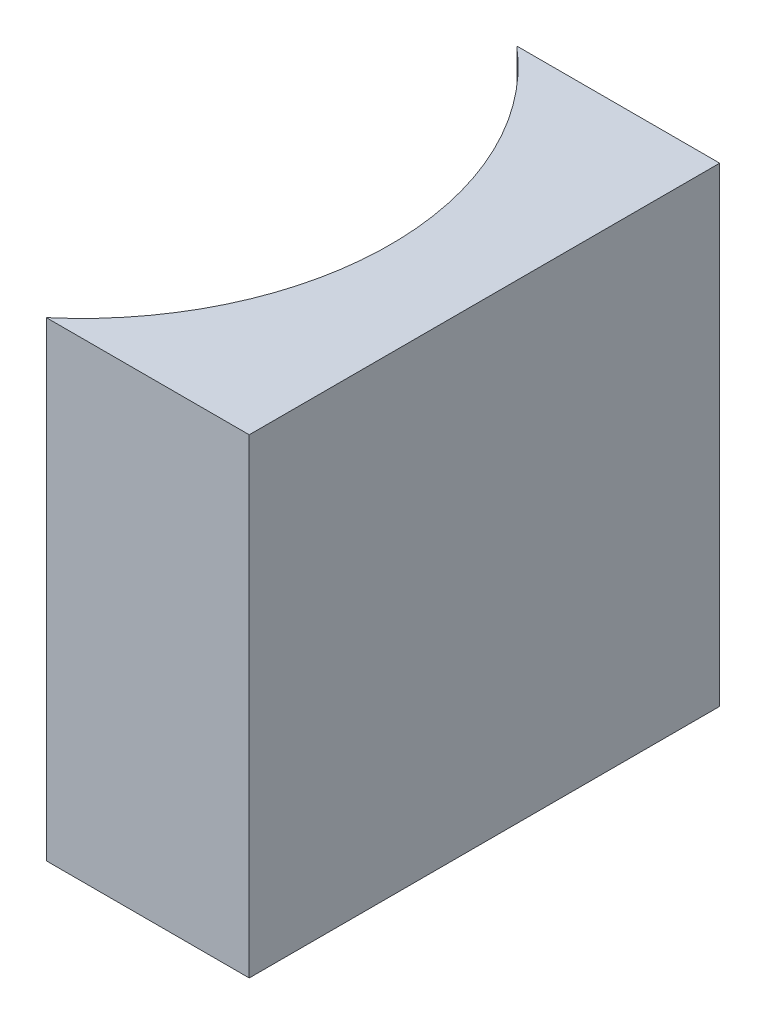
ISO-10303-21;
HEADER;
FILE_DESCRIPTION(('STEP AP214'),'2;1');
FILE_NAME('part.step','',(''),(''),'','','');
FILE_SCHEMA(('AUTOMOTIVE_DESIGN { 1 0 10303 214 1 1 1 1 }'));
ENDSEC;
DATA;
#1=APPLICATION_CONTEXT('core data for automotive mechanical design processes');
#2=APPLICATION_PROTOCOL_DEFINITION('international standard','automotive_design',2000,#1);
#3=PRODUCT_CONTEXT('',#1,'mechanical');
#4=PRODUCT('Part','Part','',(#3));
#5=PRODUCT_RELATED_PRODUCT_CATEGORY('part','',(#4));
#6=PRODUCT_DEFINITION_FORMATION('','',#4);
#7=PRODUCT_DEFINITION_CONTEXT('part definition',#1,'design');
#8=PRODUCT_DEFINITION('design','',#6,#7);
#9=PRODUCT_DEFINITION_SHAPE('','',#8);
#10=(LENGTH_UNIT() NAMED_UNIT(*) SI_UNIT(.MILLI.,.METRE.));
#11=(NAMED_UNIT(*) PLANE_ANGLE_UNIT() SI_UNIT($,.RADIAN.));
#12=(NAMED_UNIT(*) SI_UNIT($,.STERADIAN.) SOLID_ANGLE_UNIT());
#13=UNCERTAINTY_MEASURE_WITH_UNIT(LENGTH_MEASURE(1.E-05),#10,'distance_accuracy_value','');
#14=(GEOMETRIC_REPRESENTATION_CONTEXT(3) GLOBAL_UNCERTAINTY_ASSIGNED_CONTEXT((#13)) GLOBAL_UNIT_ASSIGNED_CONTEXT((#10,
#11,#12)) REPRESENTATION_CONTEXT('',''));
#15=CARTESIAN_POINT('',(0.,0.,0.));
#16=DIRECTION('',(0.,0.,1.));
#17=DIRECTION('',(1.,0.,0.));
#18=AXIS2_PLACEMENT_3D('',#15,#16,#17);
#19=CARTESIAN_POINT('',(0.,10.,0.));
#20=DIRECTION('',(0.,0.,1.));
#21=DIRECTION('',(1.,0.,0.));
#22=AXIS2_PLACEMENT_3D('',#19,#20,#21);
#23=PLANE('',#22);
#24=DIRECTION('',(-1.,0.,0.));
#25=VECTOR('',#24,1.);
#26=CARTESIAN_POINT('',(0.,0.,0.));
#27=LINE('',#26,#25);
#28=CARTESIAN_POINT('',(0.,0.,0.));
#29=VERTEX_POINT('',#28);
#30=CARTESIAN_POINT('',(-4.31340136108909,0.,0.));
#31=VERTEX_POINT('',#30);
#32=EDGE_CURVE('E100',#29,#31,#27,.T.);
#33=ORIENTED_EDGE('',*,*,#32,.T.);
#34=DIRECTION('',(0.,-1.,0.));
#35=VECTOR('',#34,1.);
#36=CARTESIAN_POINT('',(-4.31340136108909,10.,0.));
#37=LINE('',#36,#35);
#38=CARTESIAN_POINT('',(-4.31340136108909,10.,0.));
#39=VERTEX_POINT('',#38);
#40=EDGE_CURVE('E11',#39,#31,#37,.T.);
#41=ORIENTED_EDGE('',*,*,#40,.F.);
#42=DIRECTION('',(-1.,0.,0.));
#43=VECTOR('',#42,1.);
#44=CARTESIAN_POINT('',(0.,10.,0.));
#45=LINE('',#44,#43);
#46=CARTESIAN_POINT('',(0.,10.,0.));
#47=VERTEX_POINT('',#46);
#48=EDGE_CURVE('E88',#47,#39,#45,.T.);
#49=ORIENTED_EDGE('',*,*,#48,.F.);
#50=DIRECTION('',(0.,-1.,0.));
#51=VECTOR('',#50,1.);
#52=CARTESIAN_POINT('',(0.,10.,0.));
#53=LINE('',#52,#51);
#54=EDGE_CURVE('E96',#47,#29,#53,.T.);
#55=ORIENTED_EDGE('',*,*,#54,.T.);
#56=EDGE_LOOP('',(#33,#41,#49,#55));
#57=FACE_BOUND('',#56,.T.);
#58=ADVANCED_FACE('F37',(#57),#23,.F.);
#59=CARTESIAN_POINT('',(-8.56,10.,5.));
#60=DIRECTION('',(0.,-1.,0.));
#61=DIRECTION('',(0.,0.,-1.));
#62=AXIS2_PLACEMENT_3D('',#59,#60,#61);
#63=CYLINDRICAL_SURFACE('',#62,6.56);
#64=CARTESIAN_POINT('',(-8.56,0.,5.));
#65=DIRECTION('',(0.,-1.,0.));
#66=DIRECTION('',(0.,0.,1.));
#67=AXIS2_PLACEMENT_3D('',#64,#65,#66);
#68=CIRCLE('',#67,6.56);
#69=CARTESIAN_POINT('',(-4.31340136108909,0.,10.));
#70=VERTEX_POINT('',#69);
#71=EDGE_CURVE('E92',#31,#70,#68,.T.);
#72=ORIENTED_EDGE('',*,*,#71,.T.);
#73=DIRECTION('',(0.,-1.,0.));
#74=VECTOR('',#73,1.);
#75=CARTESIAN_POINT('',(-4.31340136108909,10.,10.));
#76=LINE('',#75,#74);
#77=CARTESIAN_POINT('',(-4.31340136108909,10.,10.));
#78=VERTEX_POINT('',#77);
#79=EDGE_CURVE('E45',#78,#70,#76,.T.);
#80=ORIENTED_EDGE('',*,*,#79,.F.);
#81=CARTESIAN_POINT('',(-8.56,10.,5.));
#82=DIRECTION('',(0.,-1.,0.));
#83=DIRECTION('',(0.,0.,1.));
#84=AXIS2_PLACEMENT_3D('',#81,#82,#83);
#85=CIRCLE('',#84,6.56);
#86=EDGE_CURVE('E83',#39,#78,#85,.T.);
#87=ORIENTED_EDGE('',*,*,#86,.F.);
#88=ORIENTED_EDGE('',*,*,#40,.T.);
#89=EDGE_LOOP('',(#72,#80,#87,#88));
#90=FACE_BOUND('',#89,.T.);
#91=ADVANCED_FACE('F91',(#90),#63,.F.);
#92=CARTESIAN_POINT('',(0.,10.,10.));
#93=DIRECTION('',(0.,0.,-1.));
#94=DIRECTION('',(-1.,0.,0.));
#95=AXIS2_PLACEMENT_3D('',#92,#93,#94);
#96=PLANE('',#95);
#97=DIRECTION('',(1.,0.,0.));
#98=VECTOR('',#97,1.);
#99=CARTESIAN_POINT('',(0.,0.,10.));
#100=LINE('',#99,#98);
#101=CARTESIAN_POINT('',(0.,0.,10.));
#102=VERTEX_POINT('',#101);
#103=EDGE_CURVE('E70',#70,#102,#100,.T.);
#104=ORIENTED_EDGE('',*,*,#103,.T.);
#105=DIRECTION('',(0.,-1.,0.));
#106=VECTOR('',#105,1.);
#107=CARTESIAN_POINT('',(0.,10.,10.));
#108=LINE('',#107,#106);
#109=CARTESIAN_POINT('',(0.,10.,10.));
#110=VERTEX_POINT('',#109);
#111=EDGE_CURVE('E93',#110,#102,#108,.T.);
#112=ORIENTED_EDGE('',*,*,#111,.F.);
#113=DIRECTION('',(1.,0.,0.));
#114=VECTOR('',#113,1.);
#115=CARTESIAN_POINT('',(0.,10.,10.));
#116=LINE('',#115,#114);
#117=EDGE_CURVE('E86',#78,#110,#116,.T.);
#118=ORIENTED_EDGE('',*,*,#117,.F.);
#119=ORIENTED_EDGE('',*,*,#79,.T.);
#120=EDGE_LOOP('',(#104,#112,#118,#119));
#121=FACE_BOUND('',#120,.T.);
#122=ADVANCED_FACE('F94',(#121),#96,.F.);
#123=CARTESIAN_POINT('',(0.,10.,0.));
#124=DIRECTION('',(-1.,0.,0.));
#125=DIRECTION('',(0.,0.,1.));
#126=AXIS2_PLACEMENT_3D('',#123,#124,#125);
#127=PLANE('',#126);
#128=DIRECTION('',(0.,0.,-1.));
#129=VECTOR('',#128,1.);
#130=CARTESIAN_POINT('',(0.,0.,0.));
#131=LINE('',#130,#129);
#132=EDGE_CURVE('E76',#102,#29,#131,.T.);
#133=ORIENTED_EDGE('',*,*,#132,.T.);
#134=ORIENTED_EDGE('',*,*,#54,.F.);
#135=DIRECTION('',(0.,0.,-1.));
#136=VECTOR('',#135,1.);
#137=CARTESIAN_POINT('',(0.,10.,0.));
#138=LINE('',#137,#136);
#139=EDGE_CURVE('E53',#110,#47,#138,.T.);
#140=ORIENTED_EDGE('',*,*,#139,.F.);
#141=ORIENTED_EDGE('',*,*,#111,.T.);
#142=EDGE_LOOP('',(#133,#134,#140,#141));
#143=FACE_BOUND('',#142,.T.);
#144=ADVANCED_FACE('F107',(#143),#127,.F.);
#145=CARTESIAN_POINT('',(-8.56,10.,5.));
#146=DIRECTION('',(0.,1.,0.));
#147=DIRECTION('',(0.,0.,1.));
#148=AXIS2_PLACEMENT_3D('',#145,#146,#147);
#149=PLANE('',#148);
#150=ORIENTED_EDGE('',*,*,#48,.T.);
#151=ORIENTED_EDGE('',*,*,#86,.T.);
#152=ORIENTED_EDGE('',*,*,#117,.T.);
#153=ORIENTED_EDGE('',*,*,#139,.T.);
#154=EDGE_LOOP('',(#150,#151,#152,#153));
#155=FACE_BOUND('',#154,.T.);
#156=ADVANCED_FACE('F84',(#155),#149,.T.);
#157=CARTESIAN_POINT('',(-8.56,0.,5.));
#158=DIRECTION('',(0.,1.,0.));
#159=DIRECTION('',(0.,0.,1.));
#160=AXIS2_PLACEMENT_3D('',#157,#158,#159);
#161=PLANE('',#160);
#162=ORIENTED_EDGE('',*,*,#32,.F.);
#163=ORIENTED_EDGE('',*,*,#132,.F.);
#164=ORIENTED_EDGE('',*,*,#103,.F.);
#165=ORIENTED_EDGE('',*,*,#71,.F.);
#166=EDGE_LOOP('',(#162,#163,#164,#165));
#167=FACE_BOUND('',#166,.T.);
#168=ADVANCED_FACE('F110',(#167),#161,.F.);
#169=CLOSED_SHELL('',(#58,#91,#122,#144,#156,#168));
#170=MANIFOLD_SOLID_BREP('B2',#169);
#171=ADVANCED_BREP_SHAPE_REPRESENTATION('',(#18,#170),#14);
#172=SHAPE_DEFINITION_REPRESENTATION(#9,#171);
ENDSEC;
END-ISO-10303-21;
